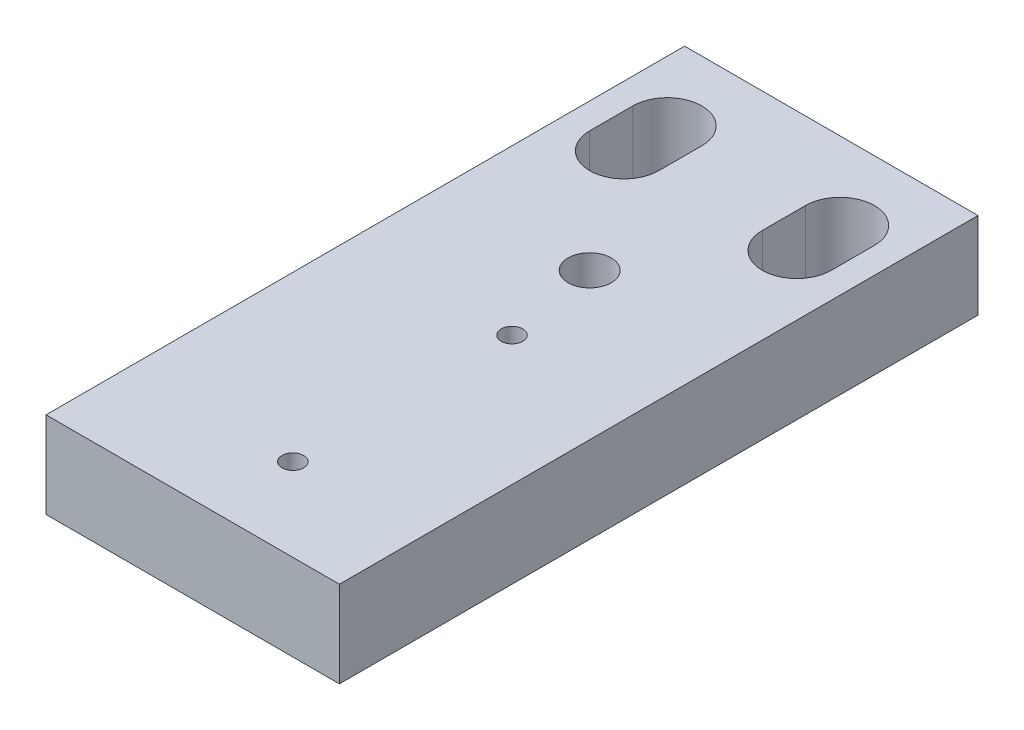
ISO-10303-21;
HEADER;
FILE_DESCRIPTION(('STEP AP214'),'2;1');
FILE_NAME('part.step','',(''),(''),'','','');
FILE_SCHEMA(('AUTOMOTIVE_DESIGN { 1 0 10303 214 1 1 1 1 }'));
ENDSEC;
DATA;
#1=APPLICATION_CONTEXT('core data for automotive mechanical design processes');
#2=APPLICATION_PROTOCOL_DEFINITION('international standard','automotive_design',2000,#1);
#3=PRODUCT_CONTEXT('',#1,'mechanical');
#4=PRODUCT('Part','Part','',(#3));
#5=PRODUCT_RELATED_PRODUCT_CATEGORY('part','',(#4));
#6=PRODUCT_DEFINITION_FORMATION('','',#4);
#7=PRODUCT_DEFINITION_CONTEXT('part definition',#1,'design');
#8=PRODUCT_DEFINITION('design','',#6,#7);
#9=PRODUCT_DEFINITION_SHAPE('','',#8);
#10=(LENGTH_UNIT() NAMED_UNIT(*) SI_UNIT(.MILLI.,.METRE.));
#11=(NAMED_UNIT(*) PLANE_ANGLE_UNIT() SI_UNIT($,.RADIAN.));
#12=(NAMED_UNIT(*) SI_UNIT($,.STERADIAN.) SOLID_ANGLE_UNIT());
#13=UNCERTAINTY_MEASURE_WITH_UNIT(LENGTH_MEASURE(1.E-05),#10,'distance_accuracy_value','');
#14=(GEOMETRIC_REPRESENTATION_CONTEXT(3) GLOBAL_UNCERTAINTY_ASSIGNED_CONTEXT((#13)) GLOBAL_UNIT_ASSIGNED_CONTEXT((#10,
#11,#12)) REPRESENTATION_CONTEXT('',''));
#15=CARTESIAN_POINT('',(0.,0.,0.));
#16=DIRECTION('',(0.,0.,1.));
#17=DIRECTION('',(1.,0.,0.));
#18=AXIS2_PLACEMENT_3D('',#15,#16,#17);
#19=CARTESIAN_POINT('',(0.,10.,0.));
#20=DIRECTION('',(0.,1.,0.));
#21=DIRECTION('',(0.,0.,1.));
#22=AXIS2_PLACEMENT_3D('',#19,#20,#21);
#23=PLANE('',#22);
#24=CARTESIAN_POINT('',(0.,10.,-9.));
#25=DIRECTION('',(0.,-1.,0.));
#26=DIRECTION('',(0.,0.,-1.));
#27=AXIS2_PLACEMENT_3D('',#24,#25,#26);
#28=CIRCLE('',#27,2.5);
#29=CARTESIAN_POINT('',(0.,10.,-11.5));
#30=VERTEX_POINT('',#29);
#31=EDGE_CURVE('P0_E170',#30,#30,#28,.T.);
#32=ORIENTED_EDGE('',*,*,#31,.T.);
#33=EDGE_LOOP('',(#32));
#34=FACE_BOUND('',#33,.T.);
#35=CARTESIAN_POINT('',(2.,10.,2.));
#36=DIRECTION('',(0.,1.,0.));
#37=DIRECTION('',(0.,0.,1.));
#38=AXIS2_PLACEMENT_3D('',#35,#36,#37);
#39=CIRCLE('',#38,1.25);
#40=CARTESIAN_POINT('',(2.,10.,3.25));
#41=VERTEX_POINT('',#40);
#42=EDGE_CURVE('P0_E173',#41,#41,#39,.F.);
#43=ORIENTED_EDGE('',*,*,#42,.T.);
#44=EDGE_LOOP('',(#43));
#45=FACE_BOUND('',#44,.T.);
#46=CARTESIAN_POINT('',(2.,10.,27.4));
#47=DIRECTION('',(0.,1.,0.));
#48=DIRECTION('',(0.,0.,1.));
#49=AXIS2_PLACEMENT_3D('',#46,#47,#48);
#50=CIRCLE('',#49,1.25);
#51=CARTESIAN_POINT('',(2.,10.,28.65));
#52=VERTEX_POINT('',#51);
#53=EDGE_CURVE('P0_E176',#52,#52,#50,.F.);
#54=ORIENTED_EDGE('',*,*,#53,.T.);
#55=EDGE_LOOP('',(#54));
#56=FACE_BOUND('',#55,.T.);
#57=CARTESIAN_POINT('',(10.,10.,-23.));
#58=DIRECTION('',(0.,1.,0.));
#59=DIRECTION('',(0.,0.,1.));
#60=AXIS2_PLACEMENT_3D('',#57,#58,#59);
#61=CIRCLE('',#60,4.);
#62=CARTESIAN_POINT('',(14.,10.,-23.));
#63=VERTEX_POINT('',#62);
#64=CARTESIAN_POINT('',(6.,10.,-23.));
#65=VERTEX_POINT('',#64);
#66=EDGE_CURVE('P0_E180',#63,#65,#61,.F.);
#67=ORIENTED_EDGE('',*,*,#66,.T.);
#68=DIRECTION('',(0.,0.,-1.));
#69=VECTOR('',#68,1.);
#70=CARTESIAN_POINT('',(6.,10.,-23.));
#71=LINE('',#70,#69);
#72=CARTESIAN_POINT('',(6.,10.,-28.));
#73=VERTEX_POINT('',#72);
#74=EDGE_CURVE('P0_E136',#73,#65,#71,.F.);
#75=ORIENTED_EDGE('',*,*,#74,.F.);
#76=CARTESIAN_POINT('',(10.,10.,-28.));
#77=DIRECTION('',(0.,1.,0.));
#78=DIRECTION('',(0.,0.,1.));
#79=AXIS2_PLACEMENT_3D('',#76,#77,#78);
#80=CIRCLE('',#79,4.);
#81=CARTESIAN_POINT('',(14.,10.,-28.));
#82=VERTEX_POINT('',#81);
#83=EDGE_CURVE('P0_E143',#73,#82,#80,.F.);
#84=ORIENTED_EDGE('',*,*,#83,.T.);
#85=DIRECTION('',(0.,0.,1.));
#86=VECTOR('',#85,1.);
#87=CARTESIAN_POINT('',(14.,10.,-28.));
#88=LINE('',#87,#86);
#89=EDGE_CURVE('P0_E140',#63,#82,#88,.F.);
#90=ORIENTED_EDGE('',*,*,#89,.F.);
#91=EDGE_LOOP('',(#67,#75,#84,#90));
#92=FACE_BOUND('',#91,.T.);
#93=CARTESIAN_POINT('',(-10.,10.,-28.));
#94=DIRECTION('',(0.,1.,0.));
#95=DIRECTION('',(0.,0.,1.));
#96=AXIS2_PLACEMENT_3D('',#93,#94,#95);
#97=CIRCLE('',#96,4.);
#98=CARTESIAN_POINT('',(-14.,10.,-28.));
#99=VERTEX_POINT('',#98);
#100=CARTESIAN_POINT('',(-6.,10.,-28.));
#101=VERTEX_POINT('',#100);
#102=EDGE_CURVE('P0_E184',#99,#101,#97,.F.);
#103=ORIENTED_EDGE('',*,*,#102,.T.);
#104=DIRECTION('',(0.,0.,1.));
#105=VECTOR('',#104,1.);
#106=CARTESIAN_POINT('',(-6.,10.,-28.));
#107=LINE('',#106,#105);
#108=CARTESIAN_POINT('',(-6.,10.,-23.));
#109=VERTEX_POINT('',#108);
#110=EDGE_CURVE('P0_E86',#109,#101,#107,.F.);
#111=ORIENTED_EDGE('',*,*,#110,.F.);
#112=CARTESIAN_POINT('',(-10.,10.,-23.));
#113=DIRECTION('',(0.,1.,0.));
#114=DIRECTION('',(0.,0.,1.));
#115=AXIS2_PLACEMENT_3D('',#112,#113,#114);
#116=CIRCLE('',#115,4.);
#117=CARTESIAN_POINT('',(-14.,10.,-23.));
#118=VERTEX_POINT('',#117);
#119=EDGE_CURVE('P0_E20',#109,#118,#116,.F.);
#120=ORIENTED_EDGE('',*,*,#119,.T.);
#121=DIRECTION('',(0.,0.,-1.));
#122=VECTOR('',#121,1.);
#123=CARTESIAN_POINT('',(-14.,10.,-23.));
#124=LINE('',#123,#122);
#125=EDGE_CURVE('P0_E147',#99,#118,#124,.F.);
#126=ORIENTED_EDGE('',*,*,#125,.F.);
#127=EDGE_LOOP('',(#103,#111,#120,#126));
#128=FACE_BOUND('',#127,.T.);
#129=DIRECTION('',(-1.,0.,0.));
#130=VECTOR('',#129,1.);
#131=CARTESIAN_POINT('',(17.,10.,-37.));
#132=LINE('',#131,#130);
#133=CARTESIAN_POINT('',(-17.,10.,-37.));
#134=VERTEX_POINT('',#133);
#135=CARTESIAN_POINT('',(17.,10.,-37.));
#136=VERTEX_POINT('',#135);
#137=EDGE_CURVE('P0_E96',#134,#136,#132,.F.);
#138=ORIENTED_EDGE('',*,*,#137,.F.);
#139=DIRECTION('',(0.,0.,1.));
#140=VECTOR('',#139,1.);
#141=CARTESIAN_POINT('',(-17.,10.,-37.));
#142=LINE('',#141,#140);
#143=CARTESIAN_POINT('',(-17.,10.,37.));
#144=VERTEX_POINT('',#143);
#145=EDGE_CURVE('P0_E123',#144,#134,#142,.F.);
#146=ORIENTED_EDGE('',*,*,#145,.F.);
#147=DIRECTION('',(1.,0.,0.));
#148=VECTOR('',#147,1.);
#149=CARTESIAN_POINT('',(-17.,10.,37.));
#150=LINE('',#149,#148);
#151=CARTESIAN_POINT('',(17.,10.,37.));
#152=VERTEX_POINT('',#151);
#153=EDGE_CURVE('P0_E114',#152,#144,#150,.F.);
#154=ORIENTED_EDGE('',*,*,#153,.F.);
#155=DIRECTION('',(0.,0.,-1.));
#156=VECTOR('',#155,1.);
#157=CARTESIAN_POINT('',(17.,10.,37.));
#158=LINE('',#157,#156);
#159=EDGE_CURVE('P0_E108',#136,#152,#158,.F.);
#160=ORIENTED_EDGE('',*,*,#159,.F.);
#161=EDGE_LOOP('',(#138,#146,#154,#160));
#162=FACE_BOUND('',#161,.T.);
#163=ADVANCED_FACE('P0_F17',(#34,#45,#56,#92,#128,#162),#23,.T.);
#164=CARTESIAN_POINT('',(-17.,0.,-37.));
#165=DIRECTION('',(-1.,0.,0.));
#166=DIRECTION('',(0.,0.,1.));
#167=AXIS2_PLACEMENT_3D('',#164,#165,#166);
#168=PLANE('',#167);
#169=DIRECTION('',(0.,1.,0.));
#170=VECTOR('',#169,1.);
#171=CARTESIAN_POINT('',(-17.,0.,-37.));
#172=LINE('',#171,#170);
#173=CARTESIAN_POINT('',(-17.,0.,-37.));
#174=VERTEX_POINT('',#173);
#175=EDGE_CURVE('P0_E200',#174,#134,#172,.T.);
#176=ORIENTED_EDGE('',*,*,#175,.F.);
#177=DIRECTION('',(0.,0.,1.));
#178=VECTOR('',#177,1.);
#179=CARTESIAN_POINT('',(-17.,0.,0.));
#180=LINE('',#179,#178);
#181=CARTESIAN_POINT('',(-17.,0.,37.));
#182=VERTEX_POINT('',#181);
#183=EDGE_CURVE('P0_E131',#174,#182,#180,.T.);
#184=ORIENTED_EDGE('',*,*,#183,.T.);
#185=DIRECTION('',(0.,1.,0.));
#186=VECTOR('',#185,1.);
#187=CARTESIAN_POINT('',(-17.,0.,37.));
#188=LINE('',#187,#186);
#189=EDGE_CURVE('P0_E119',#144,#182,#188,.F.);
#190=ORIENTED_EDGE('',*,*,#189,.F.);
#191=ORIENTED_EDGE('',*,*,#145,.T.);
#192=EDGE_LOOP('',(#176,#184,#190,#191));
#193=FACE_BOUND('',#192,.T.);
#194=ADVANCED_FACE('P0_F129',(#193),#168,.T.);
#195=CARTESIAN_POINT('',(-17.,0.,37.));
#196=DIRECTION('',(0.,0.,1.));
#197=DIRECTION('',(1.,0.,0.));
#198=AXIS2_PLACEMENT_3D('',#195,#196,#197);
#199=PLANE('',#198);
#200=ORIENTED_EDGE('',*,*,#189,.T.);
#201=DIRECTION('',(1.,0.,0.));
#202=VECTOR('',#201,1.);
#203=CARTESIAN_POINT('',(0.,0.,37.));
#204=LINE('',#203,#202);
#205=CARTESIAN_POINT('',(17.,0.,37.));
#206=VERTEX_POINT('',#205);
#207=EDGE_CURVE('P0_E210',#182,#206,#204,.T.);
#208=ORIENTED_EDGE('',*,*,#207,.T.);
#209=DIRECTION('',(0.,1.,0.));
#210=VECTOR('',#209,1.);
#211=CARTESIAN_POINT('',(17.,0.,37.));
#212=LINE('',#211,#210);
#213=EDGE_CURVE('P0_E121',#152,#206,#212,.F.);
#214=ORIENTED_EDGE('',*,*,#213,.F.);
#215=ORIENTED_EDGE('',*,*,#153,.T.);
#216=EDGE_LOOP('',(#200,#208,#214,#215));
#217=FACE_BOUND('',#216,.T.);
#218=ADVANCED_FACE('P0_F116',(#217),#199,.T.);
#219=CARTESIAN_POINT('',(17.,0.,37.));
#220=DIRECTION('',(1.,0.,0.));
#221=DIRECTION('',(0.,0.,-1.));
#222=AXIS2_PLACEMENT_3D('',#219,#220,#221);
#223=PLANE('',#222);
#224=ORIENTED_EDGE('',*,*,#213,.T.);
#225=DIRECTION('',(0.,0.,1.));
#226=VECTOR('',#225,1.);
#227=CARTESIAN_POINT('',(17.,0.,0.));
#228=LINE('',#227,#226);
#229=CARTESIAN_POINT('',(17.,0.,-37.));
#230=VERTEX_POINT('',#229);
#231=EDGE_CURVE('P0_E205',#206,#230,#228,.F.);
#232=ORIENTED_EDGE('',*,*,#231,.T.);
#233=DIRECTION('',(0.,1.,0.));
#234=VECTOR('',#233,1.);
#235=CARTESIAN_POINT('',(17.,0.,-37.));
#236=LINE('',#235,#234);
#237=EDGE_CURVE('P0_E146',#136,#230,#236,.F.);
#238=ORIENTED_EDGE('',*,*,#237,.F.);
#239=ORIENTED_EDGE('',*,*,#159,.T.);
#240=EDGE_LOOP('',(#224,#232,#238,#239));
#241=FACE_BOUND('',#240,.T.);
#242=ADVANCED_FACE('P0_F204',(#241),#223,.T.);
#243=CARTESIAN_POINT('',(17.,0.,-37.));
#244=DIRECTION('',(0.,0.,-1.));
#245=DIRECTION('',(-1.,0.,0.));
#246=AXIS2_PLACEMENT_3D('',#243,#244,#245);
#247=PLANE('',#246);
#248=ORIENTED_EDGE('',*,*,#237,.T.);
#249=DIRECTION('',(1.,0.,0.));
#250=VECTOR('',#249,1.);
#251=CARTESIAN_POINT('',(0.,0.,-37.));
#252=LINE('',#251,#250);
#253=EDGE_CURVE('P0_E212',#230,#174,#252,.F.);
#254=ORIENTED_EDGE('',*,*,#253,.T.);
#255=ORIENTED_EDGE('',*,*,#175,.T.);
#256=ORIENTED_EDGE('',*,*,#137,.T.);
#257=EDGE_LOOP('',(#248,#254,#255,#256));
#258=FACE_BOUND('',#257,.T.);
#259=ADVANCED_FACE('P0_F241',(#258),#247,.T.);
#260=CARTESIAN_POINT('',(-6.,0.,-28.));
#261=DIRECTION('',(-1.,0.,0.));
#262=DIRECTION('',(0.,0.,1.));
#263=AXIS2_PLACEMENT_3D('',#260,#261,#262);
#264=PLANE('',#263);
#265=DIRECTION('',(0.,1.,0.));
#266=VECTOR('',#265,1.);
#267=CARTESIAN_POINT('',(-6.,0.,-28.));
#268=LINE('',#267,#266);
#269=CARTESIAN_POINT('',(-6.,0.,-28.));
#270=VERTEX_POINT('',#269);
#271=EDGE_CURVE('P0_E139',#101,#270,#268,.F.);
#272=ORIENTED_EDGE('',*,*,#271,.T.);
#273=DIRECTION('',(0.,0.,1.));
#274=VECTOR('',#273,1.);
#275=CARTESIAN_POINT('',(-6.,0.,0.));
#276=LINE('',#275,#274);
#277=CARTESIAN_POINT('',(-6.,0.,-23.));
#278=VERTEX_POINT('',#277);
#279=EDGE_CURVE('P0_E169',#270,#278,#276,.T.);
#280=ORIENTED_EDGE('',*,*,#279,.T.);
#281=DIRECTION('',(0.,1.,0.));
#282=VECTOR('',#281,1.);
#283=CARTESIAN_POINT('',(-6.,0.,-23.));
#284=LINE('',#283,#282);
#285=EDGE_CURVE('P0_E145',#278,#109,#284,.T.);
#286=ORIENTED_EDGE('',*,*,#285,.T.);
#287=ORIENTED_EDGE('',*,*,#110,.T.);
#288=EDGE_LOOP('',(#272,#280,#286,#287));
#289=FACE_BOUND('',#288,.T.);
#290=ADVANCED_FACE('P0_F244',(#289),#264,.T.);
#291=CARTESIAN_POINT('',(-10.,0.,-23.));
#292=DIRECTION('',(0.,1.,0.));
#293=DIRECTION('',(0.,0.,1.));
#294=AXIS2_PLACEMENT_3D('',#291,#292,#293);
#295=CYLINDRICAL_SURFACE('',#294,4.);
#296=ORIENTED_EDGE('',*,*,#119,.F.);
#297=ORIENTED_EDGE('',*,*,#285,.F.);
#298=CARTESIAN_POINT('',(-10.,0.,-23.));
#299=DIRECTION('',(0.,1.,0.));
#300=DIRECTION('',(0.,0.,1.));
#301=AXIS2_PLACEMENT_3D('',#298,#299,#300);
#302=CIRCLE('',#301,4.);
#303=CARTESIAN_POINT('',(-14.,0.,-23.));
#304=VERTEX_POINT('',#303);
#305=EDGE_CURVE('P0_E166',#278,#304,#302,.F.);
#306=ORIENTED_EDGE('',*,*,#305,.T.);
#307=DIRECTION('',(0.,1.,0.));
#308=VECTOR('',#307,1.);
#309=CARTESIAN_POINT('',(-14.,0.,-23.));
#310=LINE('',#309,#308);
#311=EDGE_CURVE('P0_E148',#118,#304,#310,.F.);
#312=ORIENTED_EDGE('',*,*,#311,.F.);
#313=EDGE_LOOP('',(#296,#297,#306,#312));
#314=FACE_BOUND('',#313,.T.);
#315=ADVANCED_FACE('P0_F251',(#314),#295,.F.);
#316=CARTESIAN_POINT('',(-14.,0.,-23.));
#317=DIRECTION('',(1.,0.,0.));
#318=DIRECTION('',(0.,0.,-1.));
#319=AXIS2_PLACEMENT_3D('',#316,#317,#318);
#320=PLANE('',#319);
#321=ORIENTED_EDGE('',*,*,#311,.T.);
#322=DIRECTION('',(0.,0.,1.));
#323=VECTOR('',#322,1.);
#324=CARTESIAN_POINT('',(-14.,0.,0.));
#325=LINE('',#324,#323);
#326=CARTESIAN_POINT('',(-14.,0.,-28.));
#327=VERTEX_POINT('',#326);
#328=EDGE_CURVE('P0_E165',#304,#327,#325,.F.);
#329=ORIENTED_EDGE('',*,*,#328,.T.);
#330=DIRECTION('',(0.,1.,0.));
#331=VECTOR('',#330,1.);
#332=CARTESIAN_POINT('',(-14.,0.,-28.));
#333=LINE('',#332,#331);
#334=EDGE_CURVE('P0_E185',#327,#99,#333,.T.);
#335=ORIENTED_EDGE('',*,*,#334,.T.);
#336=ORIENTED_EDGE('',*,*,#125,.T.);
#337=EDGE_LOOP('',(#321,#329,#335,#336));
#338=FACE_BOUND('',#337,.T.);
#339=ADVANCED_FACE('P0_F288',(#338),#320,.T.);
#340=CARTESIAN_POINT('',(-10.,0.,-28.));
#341=DIRECTION('',(0.,1.,0.));
#342=DIRECTION('',(0.,0.,1.));
#343=AXIS2_PLACEMENT_3D('',#340,#341,#342);
#344=CYLINDRICAL_SURFACE('',#343,4.);
#345=ORIENTED_EDGE('',*,*,#102,.F.);
#346=ORIENTED_EDGE('',*,*,#334,.F.);
#347=CARTESIAN_POINT('',(-10.,0.,-28.));
#348=DIRECTION('',(0.,1.,0.));
#349=DIRECTION('',(0.,0.,1.));
#350=AXIS2_PLACEMENT_3D('',#347,#348,#349);
#351=CIRCLE('',#350,4.);
#352=EDGE_CURVE('P0_E162',#327,#270,#351,.F.);
#353=ORIENTED_EDGE('',*,*,#352,.T.);
#354=ORIENTED_EDGE('',*,*,#271,.F.);
#355=EDGE_LOOP('',(#345,#346,#353,#354));
#356=FACE_BOUND('',#355,.T.);
#357=ADVANCED_FACE('P0_F285',(#356),#344,.F.);
#358=CARTESIAN_POINT('',(6.,0.,-23.));
#359=DIRECTION('',(1.,0.,0.));
#360=DIRECTION('',(0.,0.,-1.));
#361=AXIS2_PLACEMENT_3D('',#358,#359,#360);
#362=PLANE('',#361);
#363=DIRECTION('',(0.,1.,0.));
#364=VECTOR('',#363,1.);
#365=CARTESIAN_POINT('',(6.,0.,-23.));
#366=LINE('',#365,#364);
#367=CARTESIAN_POINT('',(6.,0.,-23.));
#368=VERTEX_POINT('',#367);
#369=EDGE_CURVE('P0_E179',#65,#368,#366,.F.);
#370=ORIENTED_EDGE('',*,*,#369,.T.);
#371=DIRECTION('',(0.,0.,1.));
#372=VECTOR('',#371,1.);
#373=CARTESIAN_POINT('',(6.,0.,0.));
#374=LINE('',#373,#372);
#375=CARTESIAN_POINT('',(6.,0.,-28.));
#376=VERTEX_POINT('',#375);
#377=EDGE_CURVE('P0_E161',#368,#376,#374,.F.);
#378=ORIENTED_EDGE('',*,*,#377,.T.);
#379=DIRECTION('',(0.,1.,0.));
#380=VECTOR('',#379,1.);
#381=CARTESIAN_POINT('',(6.,0.,-28.));
#382=LINE('',#381,#380);
#383=EDGE_CURVE('P0_E138',#376,#73,#382,.T.);
#384=ORIENTED_EDGE('',*,*,#383,.T.);
#385=ORIENTED_EDGE('',*,*,#74,.T.);
#386=EDGE_LOOP('',(#370,#378,#384,#385));
#387=FACE_BOUND('',#386,.T.);
#388=ADVANCED_FACE('P0_F224',(#387),#362,.T.);
#389=CARTESIAN_POINT('',(10.,0.,-28.));
#390=DIRECTION('',(0.,1.,0.));
#391=DIRECTION('',(0.,0.,1.));
#392=AXIS2_PLACEMENT_3D('',#389,#390,#391);
#393=CYLINDRICAL_SURFACE('',#392,4.);
#394=ORIENTED_EDGE('',*,*,#83,.F.);
#395=ORIENTED_EDGE('',*,*,#383,.F.);
#396=CARTESIAN_POINT('',(10.,0.,-28.));
#397=DIRECTION('',(0.,1.,0.));
#398=DIRECTION('',(0.,0.,1.));
#399=AXIS2_PLACEMENT_3D('',#396,#397,#398);
#400=CIRCLE('',#399,4.);
#401=CARTESIAN_POINT('',(14.,0.,-28.));
#402=VERTEX_POINT('',#401);
#403=EDGE_CURVE('P0_E158',#376,#402,#400,.F.);
#404=ORIENTED_EDGE('',*,*,#403,.T.);
#405=DIRECTION('',(0.,1.,0.));
#406=VECTOR('',#405,1.);
#407=CARTESIAN_POINT('',(14.,0.,-28.));
#408=LINE('',#407,#406);
#409=EDGE_CURVE('P0_E142',#82,#402,#408,.F.);
#410=ORIENTED_EDGE('',*,*,#409,.F.);
#411=EDGE_LOOP('',(#394,#395,#404,#410));
#412=FACE_BOUND('',#411,.T.);
#413=ADVANCED_FACE('P0_F229',(#412),#393,.F.);
#414=CARTESIAN_POINT('',(14.,0.,-28.));
#415=DIRECTION('',(-1.,0.,0.));
#416=DIRECTION('',(0.,0.,1.));
#417=AXIS2_PLACEMENT_3D('',#414,#415,#416);
#418=PLANE('',#417);
#419=ORIENTED_EDGE('',*,*,#409,.T.);
#420=DIRECTION('',(0.,0.,1.));
#421=VECTOR('',#420,1.);
#422=CARTESIAN_POINT('',(14.,0.,0.));
#423=LINE('',#422,#421);
#424=CARTESIAN_POINT('',(14.,0.,-23.));
#425=VERTEX_POINT('',#424);
#426=EDGE_CURVE('P0_E157',#402,#425,#423,.T.);
#427=ORIENTED_EDGE('',*,*,#426,.T.);
#428=DIRECTION('',(0.,1.,0.));
#429=VECTOR('',#428,1.);
#430=CARTESIAN_POINT('',(14.,0.,-23.));
#431=LINE('',#430,#429);
#432=EDGE_CURVE('P0_E35',#425,#63,#431,.T.);
#433=ORIENTED_EDGE('',*,*,#432,.T.);
#434=ORIENTED_EDGE('',*,*,#89,.T.);
#435=EDGE_LOOP('',(#419,#427,#433,#434));
#436=FACE_BOUND('',#435,.T.);
#437=ADVANCED_FACE('P0_F278',(#436),#418,.T.);
#438=CARTESIAN_POINT('',(10.,0.,-23.));
#439=DIRECTION('',(0.,1.,0.));
#440=DIRECTION('',(0.,0.,1.));
#441=AXIS2_PLACEMENT_3D('',#438,#439,#440);
#442=CYLINDRICAL_SURFACE('',#441,4.);
#443=ORIENTED_EDGE('',*,*,#66,.F.);
#444=ORIENTED_EDGE('',*,*,#432,.F.);
#445=CARTESIAN_POINT('',(10.,0.,-23.));
#446=DIRECTION('',(0.,1.,0.));
#447=DIRECTION('',(0.,0.,1.));
#448=AXIS2_PLACEMENT_3D('',#445,#446,#447);
#449=CIRCLE('',#448,4.);
#450=EDGE_CURVE('P0_E155',#425,#368,#449,.F.);
#451=ORIENTED_EDGE('',*,*,#450,.T.);
#452=ORIENTED_EDGE('',*,*,#369,.F.);
#453=EDGE_LOOP('',(#443,#444,#451,#452));
#454=FACE_BOUND('',#453,.T.);
#455=ADVANCED_FACE('P0_F274',(#454),#442,.F.);
#456=CARTESIAN_POINT('',(2.,-1.55,27.4));
#457=DIRECTION('',(0.,1.,0.));
#458=DIRECTION('',(0.,0.,1.));
#459=AXIS2_PLACEMENT_3D('',#456,#457,#458);
#460=CYLINDRICAL_SURFACE('',#459,1.25);
#461=ORIENTED_EDGE('',*,*,#53,.F.);
#462=EDGE_LOOP('',(#461));
#463=FACE_BOUND('',#462,.T.);
#464=CARTESIAN_POINT('',(2.,0.,27.4));
#465=DIRECTION('',(0.,1.,0.));
#466=DIRECTION('',(0.,0.,1.));
#467=AXIS2_PLACEMENT_3D('',#464,#465,#466);
#468=CIRCLE('',#467,1.25);
#469=CARTESIAN_POINT('',(2.,0.,28.65));
#470=VERTEX_POINT('',#469);
#471=EDGE_CURVE('P0_E152',#470,#470,#468,.F.);
#472=ORIENTED_EDGE('',*,*,#471,.T.);
#473=EDGE_LOOP('',(#472));
#474=FACE_BOUND('',#473,.T.);
#475=ADVANCED_FACE('P0_F270',(#463,#474),#460,.F.);
#476=CARTESIAN_POINT('',(2.,-1.55,2.));
#477=DIRECTION('',(0.,1.,0.));
#478=DIRECTION('',(0.,0.,1.));
#479=AXIS2_PLACEMENT_3D('',#476,#477,#478);
#480=CYLINDRICAL_SURFACE('',#479,1.25);
#481=ORIENTED_EDGE('',*,*,#42,.F.);
#482=EDGE_LOOP('',(#481));
#483=FACE_BOUND('',#482,.T.);
#484=CARTESIAN_POINT('',(2.,0.,2.));
#485=DIRECTION('',(0.,1.,0.));
#486=DIRECTION('',(0.,0.,1.));
#487=AXIS2_PLACEMENT_3D('',#484,#485,#486);
#488=CIRCLE('',#487,1.25);
#489=CARTESIAN_POINT('',(2.,0.,3.25));
#490=VERTEX_POINT('',#489);
#491=EDGE_CURVE('P0_E26',#490,#490,#488,.F.);
#492=ORIENTED_EDGE('',*,*,#491,.T.);
#493=EDGE_LOOP('',(#492));
#494=FACE_BOUND('',#493,.T.);
#495=ADVANCED_FACE('P0_F262',(#483,#494),#480,.F.);
#496=CARTESIAN_POINT('',(0.,10.,-9.));
#497=DIRECTION('',(0.,-1.,0.));
#498=DIRECTION('',(0.,0.,-1.));
#499=AXIS2_PLACEMENT_3D('',#496,#497,#498);
#500=CYLINDRICAL_SURFACE('',#499,2.5);
#501=ORIENTED_EDGE('',*,*,#31,.F.);
#502=EDGE_LOOP('',(#501));
#503=FACE_BOUND('',#502,.T.);
#504=CARTESIAN_POINT('',(0.,0.,-9.));
#505=DIRECTION('',(0.,-1.,0.));
#506=DIRECTION('',(0.,0.,-1.));
#507=AXIS2_PLACEMENT_3D('',#504,#505,#506);
#508=CIRCLE('',#507,2.5);
#509=CARTESIAN_POINT('',(0.,0.,-11.5));
#510=VERTEX_POINT('',#509);
#511=EDGE_CURVE('P0_E11',#510,#510,#508,.T.);
#512=ORIENTED_EDGE('',*,*,#511,.T.);
#513=EDGE_LOOP('',(#512));
#514=FACE_BOUND('',#513,.T.);
#515=ADVANCED_FACE('P0_F256',(#503,#514),#500,.F.);
#516=CARTESIAN_POINT('',(0.,0.,0.));
#517=DIRECTION('',(0.,1.,0.));
#518=DIRECTION('',(0.,0.,1.));
#519=AXIS2_PLACEMENT_3D('',#516,#517,#518);
#520=PLANE('',#519);
#521=ORIENTED_EDGE('',*,*,#511,.F.);
#522=EDGE_LOOP('',(#521));
#523=FACE_BOUND('',#522,.T.);
#524=ORIENTED_EDGE('',*,*,#491,.F.);
#525=EDGE_LOOP('',(#524));
#526=FACE_BOUND('',#525,.T.);
#527=ORIENTED_EDGE('',*,*,#471,.F.);
#528=EDGE_LOOP('',(#527));
#529=FACE_BOUND('',#528,.T.);
#530=ORIENTED_EDGE('',*,*,#426,.F.);
#531=ORIENTED_EDGE('',*,*,#403,.F.);
#532=ORIENTED_EDGE('',*,*,#377,.F.);
#533=ORIENTED_EDGE('',*,*,#450,.F.);
#534=EDGE_LOOP('',(#530,#531,#532,#533));
#535=FACE_BOUND('',#534,.T.);
#536=ORIENTED_EDGE('',*,*,#328,.F.);
#537=ORIENTED_EDGE('',*,*,#305,.F.);
#538=ORIENTED_EDGE('',*,*,#279,.F.);
#539=ORIENTED_EDGE('',*,*,#352,.F.);
#540=EDGE_LOOP('',(#536,#537,#538,#539));
#541=FACE_BOUND('',#540,.T.);
#542=ORIENTED_EDGE('',*,*,#231,.F.);
#543=ORIENTED_EDGE('',*,*,#207,.F.);
#544=ORIENTED_EDGE('',*,*,#183,.F.);
#545=ORIENTED_EDGE('',*,*,#253,.F.);
#546=EDGE_LOOP('',(#542,#543,#544,#545));
#547=FACE_BOUND('',#546,.T.);
#548=ADVANCED_FACE('P0_F209',(#523,#526,#529,#535,#541,#547),#520,.F.);
#549=CLOSED_SHELL('',(#163,#194,#218,#242,#259,#290,#315,#339,#357,#388,#413,#437,#455,#475,
#495,#515,#548));
#550=MANIFOLD_SOLID_BREP('P0_B1',#549);
#551=CARTESIAN_POINT('',(2.,-1.55,2.));
#552=DIRECTION('',(0.,1.,0.));
#553=DIRECTION('',(0.,0.,1.));
#554=AXIS2_PLACEMENT_3D('',#551,#552,#553);
#555=CYLINDRICAL_SURFACE('',#554,1.5);
#556=CARTESIAN_POINT('',(2.,10.,2.));
#557=DIRECTION('',(0.,1.,0.));
#558=DIRECTION('',(0.,0.,1.));
#559=AXIS2_PLACEMENT_3D('',#556,#557,#558);
#560=CIRCLE('',#559,1.5);
#561=CARTESIAN_POINT('',(2.,10.,3.5));
#562=VERTEX_POINT('',#561);
#563=EDGE_CURVE('P1_E10',#562,#562,#560,.F.);
#564=ORIENTED_EDGE('',*,*,#563,.T.);
#565=EDGE_LOOP('',(#564));
#566=FACE_BOUND('',#565,.T.);
#567=CARTESIAN_POINT('',(2.,0.,2.));
#568=DIRECTION('',(0.,1.,0.));
#569=DIRECTION('',(0.,0.,1.));
#570=AXIS2_PLACEMENT_3D('',#567,#568,#569);
#571=CIRCLE('',#570,1.5);
#572=CARTESIAN_POINT('',(2.,0.,3.5));
#573=VERTEX_POINT('',#572);
#574=EDGE_CURVE('P1_E16',#573,#573,#571,.T.);
#575=ORIENTED_EDGE('',*,*,#574,.T.);
#576=EDGE_LOOP('',(#575));
#577=FACE_BOUND('',#576,.T.);
#578=ADVANCED_FACE('P1_F15',(#566,#577),#555,.T.);
#579=OPEN_SHELL('',(#578));
#580=SHELL_BASED_SURFACE_MODEL('P1_B1',(#579));
#581=CARTESIAN_POINT('',(2.,-1.55,27.4));
#582=DIRECTION('',(0.,1.,0.));
#583=DIRECTION('',(0.,0.,1.));
#584=AXIS2_PLACEMENT_3D('',#581,#582,#583);
#585=CYLINDRICAL_SURFACE('',#584,1.5);
#586=CARTESIAN_POINT('',(2.,10.,27.4));
#587=DIRECTION('',(0.,1.,0.));
#588=DIRECTION('',(0.,0.,1.));
#589=AXIS2_PLACEMENT_3D('',#586,#587,#588);
#590=CIRCLE('',#589,1.5);
#591=CARTESIAN_POINT('',(2.,10.,28.9));
#592=VERTEX_POINT('',#591);
#593=EDGE_CURVE('P2_E10',#592,#592,#590,.F.);
#594=ORIENTED_EDGE('',*,*,#593,.T.);
#595=EDGE_LOOP('',(#594));
#596=FACE_BOUND('',#595,.T.);
#597=CARTESIAN_POINT('',(2.,0.,27.4));
#598=DIRECTION('',(0.,1.,0.));
#599=DIRECTION('',(0.,0.,1.));
#600=AXIS2_PLACEMENT_3D('',#597,#598,#599);
#601=CIRCLE('',#600,1.5);
#602=CARTESIAN_POINT('',(2.,0.,28.9));
#603=VERTEX_POINT('',#602);
#604=EDGE_CURVE('P2_E16',#603,#603,#601,.T.);
#605=ORIENTED_EDGE('',*,*,#604,.T.);
#606=EDGE_LOOP('',(#605));
#607=FACE_BOUND('',#606,.T.);
#608=ADVANCED_FACE('P2_F15',(#596,#607),#585,.T.);
#609=OPEN_SHELL('',(#608));
#610=SHELL_BASED_SURFACE_MODEL('P2_B1',(#609));
#611=ADVANCED_BREP_SHAPE_REPRESENTATION('',(#18,#550),#14);
#612=MANIFOLD_SURFACE_SHAPE_REPRESENTATION('',(#18,#580,#610),#14);
#613=SHAPE_REPRESENTATION('',(#18),#14);
#614=SHAPE_DEFINITION_REPRESENTATION(#9,#613);
#615=SHAPE_REPRESENTATION_RELATIONSHIP('','',#613,#611);
#616=SHAPE_REPRESENTATION_RELATIONSHIP('','',#613,#612);
ENDSEC;
END-ISO-10303-21;
